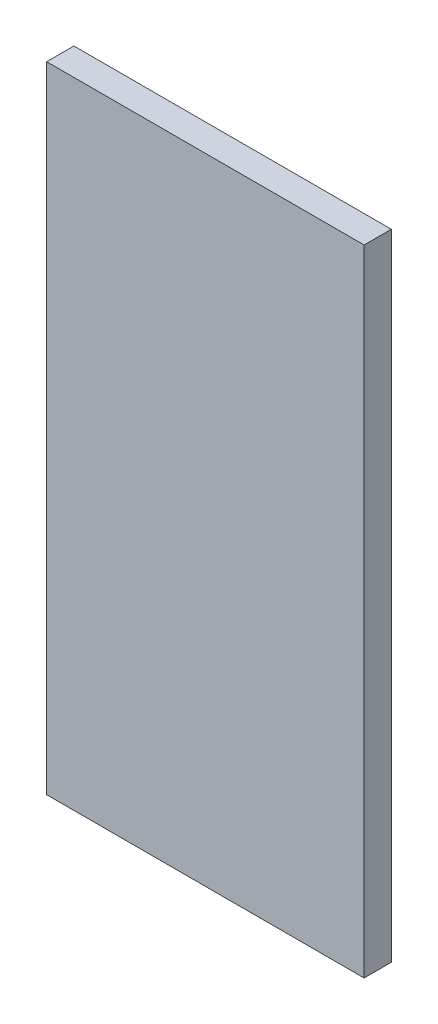
ISO-10303-21;
HEADER;
FILE_DESCRIPTION(('STEP AP214'),'2;1');
FILE_NAME('part.step','',(''),(''),'','','');
FILE_SCHEMA(('AUTOMOTIVE_DESIGN { 1 0 10303 214 1 1 1 1 }'));
ENDSEC;
DATA;
#1=APPLICATION_CONTEXT('core data for automotive mechanical design processes');
#2=APPLICATION_PROTOCOL_DEFINITION('international standard','automotive_design',2000,#1);
#3=PRODUCT_CONTEXT('',#1,'mechanical');
#4=PRODUCT('Part','Part','',(#3));
#5=PRODUCT_RELATED_PRODUCT_CATEGORY('part','',(#4));
#6=PRODUCT_DEFINITION_FORMATION('','',#4);
#7=PRODUCT_DEFINITION_CONTEXT('part definition',#1,'design');
#8=PRODUCT_DEFINITION('design','',#6,#7);
#9=PRODUCT_DEFINITION_SHAPE('','',#8);
#10=(LENGTH_UNIT() NAMED_UNIT(*) SI_UNIT(.MILLI.,.METRE.));
#11=(NAMED_UNIT(*) PLANE_ANGLE_UNIT() SI_UNIT($,.RADIAN.));
#12=(NAMED_UNIT(*) SI_UNIT($,.STERADIAN.) SOLID_ANGLE_UNIT());
#13=UNCERTAINTY_MEASURE_WITH_UNIT(LENGTH_MEASURE(1.E-05),#10,'distance_accuracy_value','');
#14=(GEOMETRIC_REPRESENTATION_CONTEXT(3) GLOBAL_UNCERTAINTY_ASSIGNED_CONTEXT((#13)) GLOBAL_UNIT_ASSIGNED_CONTEXT((#10,
#11,#12)) REPRESENTATION_CONTEXT('',''));
#15=CARTESIAN_POINT('',(0.,0.,0.));
#16=DIRECTION('',(0.,0.,1.));
#17=DIRECTION('',(1.,0.,0.));
#18=AXIS2_PLACEMENT_3D('',#15,#16,#17);
#19=CARTESIAN_POINT('',(0.,0.,3.));
#20=DIRECTION('',(1.,0.,0.));
#21=DIRECTION('',(0.,1.,0.));
#22=AXIS2_PLACEMENT_3D('',#19,#20,#21);
#23=PLANE('',#22);
#24=DIRECTION('',(0.,-1.,0.));
#25=VECTOR('',#24,1.);
#26=CARTESIAN_POINT('',(0.,0.,0.));
#27=LINE('',#26,#25);
#28=CARTESIAN_POINT('',(0.,0.,0.));
#29=VERTEX_POINT('',#28);
#30=CARTESIAN_POINT('',(0.,-70.,0.));
#31=VERTEX_POINT('',#30);
#32=EDGE_CURVE('E96',#29,#31,#27,.T.);
#33=ORIENTED_EDGE('',*,*,#32,.T.);
#34=DIRECTION('',(0.,0.,-1.));
#35=VECTOR('',#34,1.);
#36=CARTESIAN_POINT('',(0.,-70.,3.));
#37=LINE('',#36,#35);
#38=CARTESIAN_POINT('',(0.,-70.,3.));
#39=VERTEX_POINT('',#38);
#40=EDGE_CURVE('E11',#39,#31,#37,.T.);
#41=ORIENTED_EDGE('',*,*,#40,.F.);
#42=DIRECTION('',(0.,-1.,0.));
#43=VECTOR('',#42,1.);
#44=CARTESIAN_POINT('',(0.,0.,3.));
#45=LINE('',#44,#43);
#46=CARTESIAN_POINT('',(0.,0.,3.));
#47=VERTEX_POINT('',#46);
#48=EDGE_CURVE('E84',#47,#39,#45,.T.);
#49=ORIENTED_EDGE('',*,*,#48,.F.);
#50=DIRECTION('',(0.,0.,-1.));
#51=VECTOR('',#50,1.);
#52=CARTESIAN_POINT('',(0.,0.,3.));
#53=LINE('',#52,#51);
#54=EDGE_CURVE('E92',#47,#29,#53,.T.);
#55=ORIENTED_EDGE('',*,*,#54,.T.);
#56=EDGE_LOOP('',(#33,#41,#49,#55));
#57=FACE_BOUND('',#56,.T.);
#58=ADVANCED_FACE('F33',(#57),#23,.F.);
#59=CARTESIAN_POINT('',(0.,-70.,3.));
#60=DIRECTION('',(0.,1.,0.));
#61=DIRECTION('',(0.,0.,1.));
#62=AXIS2_PLACEMENT_3D('',#59,#60,#61);
#63=PLANE('',#62);
#64=DIRECTION('',(1.,0.,0.));
#65=VECTOR('',#64,1.);
#66=CARTESIAN_POINT('',(0.,-70.,0.));
#67=LINE('',#66,#65);
#68=CARTESIAN_POINT('',(35.,-70.,0.));
#69=VERTEX_POINT('',#68);
#70=EDGE_CURVE('E88',#31,#69,#67,.T.);
#71=ORIENTED_EDGE('',*,*,#70,.T.);
#72=DIRECTION('',(0.,0.,-1.));
#73=VECTOR('',#72,1.);
#74=CARTESIAN_POINT('',(35.,-70.,3.));
#75=LINE('',#74,#73);
#76=CARTESIAN_POINT('',(35.,-70.,3.));
#77=VERTEX_POINT('',#76);
#78=EDGE_CURVE('E41',#77,#69,#75,.T.);
#79=ORIENTED_EDGE('',*,*,#78,.F.);
#80=DIRECTION('',(1.,0.,0.));
#81=VECTOR('',#80,1.);
#82=CARTESIAN_POINT('',(0.,-70.,3.));
#83=LINE('',#82,#81);
#84=EDGE_CURVE('E79',#39,#77,#83,.T.);
#85=ORIENTED_EDGE('',*,*,#84,.F.);
#86=ORIENTED_EDGE('',*,*,#40,.T.);
#87=EDGE_LOOP('',(#71,#79,#85,#86));
#88=FACE_BOUND('',#87,.T.);
#89=ADVANCED_FACE('F87',(#88),#63,.F.);
#90=CARTESIAN_POINT('',(35.,0.,3.));
#91=DIRECTION('',(-1.,0.,0.));
#92=DIRECTION('',(0.,-1.,0.));
#93=AXIS2_PLACEMENT_3D('',#90,#91,#92);
#94=PLANE('',#93);
#95=DIRECTION('',(0.,1.,0.));
#96=VECTOR('',#95,1.);
#97=CARTESIAN_POINT('',(35.,0.,0.));
#98=LINE('',#97,#96);
#99=CARTESIAN_POINT('',(35.,0.,0.));
#100=VERTEX_POINT('',#99);
#101=EDGE_CURVE('E66',#69,#100,#98,.T.);
#102=ORIENTED_EDGE('',*,*,#101,.T.);
#103=DIRECTION('',(0.,0.,-1.));
#104=VECTOR('',#103,1.);
#105=CARTESIAN_POINT('',(35.,0.,3.));
#106=LINE('',#105,#104);
#107=CARTESIAN_POINT('',(35.,0.,3.));
#108=VERTEX_POINT('',#107);
#109=EDGE_CURVE('E89',#108,#100,#106,.T.);
#110=ORIENTED_EDGE('',*,*,#109,.F.);
#111=DIRECTION('',(0.,1.,0.));
#112=VECTOR('',#111,1.);
#113=CARTESIAN_POINT('',(35.,0.,3.));
#114=LINE('',#113,#112);
#115=EDGE_CURVE('E82',#77,#108,#114,.T.);
#116=ORIENTED_EDGE('',*,*,#115,.F.);
#117=ORIENTED_EDGE('',*,*,#78,.T.);
#118=EDGE_LOOP('',(#102,#110,#116,#117));
#119=FACE_BOUND('',#118,.T.);
#120=ADVANCED_FACE('F90',(#119),#94,.F.);
#121=CARTESIAN_POINT('',(0.,0.,3.));
#122=DIRECTION('',(0.,-1.,0.));
#123=DIRECTION('',(0.,0.,-1.));
#124=AXIS2_PLACEMENT_3D('',#121,#122,#123);
#125=PLANE('',#124);
#126=DIRECTION('',(-1.,0.,0.));
#127=VECTOR('',#126,1.);
#128=CARTESIAN_POINT('',(0.,0.,0.));
#129=LINE('',#128,#127);
#130=EDGE_CURVE('E72',#100,#29,#129,.T.);
#131=ORIENTED_EDGE('',*,*,#130,.T.);
#132=ORIENTED_EDGE('',*,*,#54,.F.);
#133=DIRECTION('',(-1.,0.,0.));
#134=VECTOR('',#133,1.);
#135=CARTESIAN_POINT('',(0.,0.,3.));
#136=LINE('',#135,#134);
#137=EDGE_CURVE('E49',#108,#47,#136,.T.);
#138=ORIENTED_EDGE('',*,*,#137,.F.);
#139=ORIENTED_EDGE('',*,*,#109,.T.);
#140=EDGE_LOOP('',(#131,#132,#138,#139));
#141=FACE_BOUND('',#140,.T.);
#142=ADVANCED_FACE('F103',(#141),#125,.F.);
#143=CARTESIAN_POINT('',(0.,0.,3.));
#144=DIRECTION('',(0.,0.,1.));
#145=DIRECTION('',(1.,0.,0.));
#146=AXIS2_PLACEMENT_3D('',#143,#144,#145);
#147=PLANE('',#146);
#148=ORIENTED_EDGE('',*,*,#48,.T.);
#149=ORIENTED_EDGE('',*,*,#84,.T.);
#150=ORIENTED_EDGE('',*,*,#115,.T.);
#151=ORIENTED_EDGE('',*,*,#137,.T.);
#152=EDGE_LOOP('',(#148,#149,#150,#151));
#153=FACE_BOUND('',#152,.T.);
#154=ADVANCED_FACE('F80',(#153),#147,.T.);
#155=CARTESIAN_POINT('',(0.,0.,0.));
#156=DIRECTION('',(0.,0.,1.));
#157=DIRECTION('',(1.,0.,0.));
#158=AXIS2_PLACEMENT_3D('',#155,#156,#157);
#159=PLANE('',#158);
#160=ORIENTED_EDGE('',*,*,#32,.F.);
#161=ORIENTED_EDGE('',*,*,#130,.F.);
#162=ORIENTED_EDGE('',*,*,#101,.F.);
#163=ORIENTED_EDGE('',*,*,#70,.F.);
#164=EDGE_LOOP('',(#160,#161,#162,#163));
#165=FACE_BOUND('',#164,.T.);
#166=ADVANCED_FACE('F106',(#165),#159,.F.);
#167=CLOSED_SHELL('',(#58,#89,#120,#142,#154,#166));
#168=MANIFOLD_SOLID_BREP('B2',#167);
#169=ADVANCED_BREP_SHAPE_REPRESENTATION('',(#18,#168),#14);
#170=SHAPE_DEFINITION_REPRESENTATION(#9,#169);
ENDSEC;
END-ISO-10303-21;
